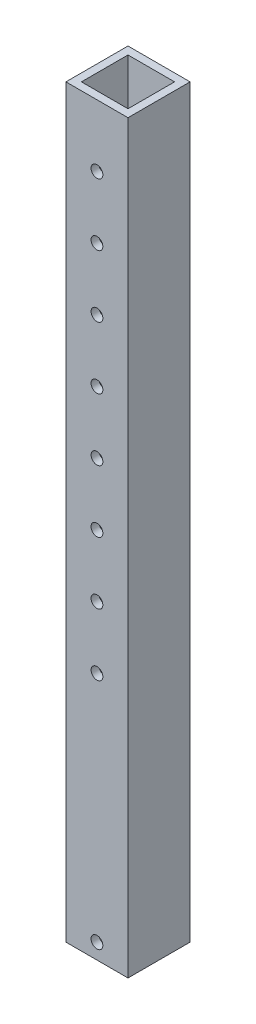
ISO-10303-21;
HEADER;
FILE_DESCRIPTION(('STEP AP214'),'2;1');
FILE_NAME('part.step','',(''),(''),'','','');
FILE_SCHEMA(('AUTOMOTIVE_DESIGN { 1 0 10303 214 1 1 1 1 }'));
ENDSEC;
DATA;
#1=APPLICATION_CONTEXT('core data for automotive mechanical design processes');
#2=APPLICATION_PROTOCOL_DEFINITION('international standard','automotive_design',2000,#1);
#3=PRODUCT_CONTEXT('',#1,'mechanical');
#4=PRODUCT('Part','Part','',(#3));
#5=PRODUCT_RELATED_PRODUCT_CATEGORY('part','',(#4));
#6=PRODUCT_DEFINITION_FORMATION('','',#4);
#7=PRODUCT_DEFINITION_CONTEXT('part definition',#1,'design');
#8=PRODUCT_DEFINITION('design','',#6,#7);
#9=PRODUCT_DEFINITION_SHAPE('','',#8);
#10=(LENGTH_UNIT() NAMED_UNIT(*) SI_UNIT(.MILLI.,.METRE.));
#11=(NAMED_UNIT(*) PLANE_ANGLE_UNIT() SI_UNIT($,.RADIAN.));
#12=(NAMED_UNIT(*) SI_UNIT($,.STERADIAN.) SOLID_ANGLE_UNIT());
#13=UNCERTAINTY_MEASURE_WITH_UNIT(LENGTH_MEASURE(1.E-05),#10,'distance_accuracy_value','');
#14=(GEOMETRIC_REPRESENTATION_CONTEXT(3) GLOBAL_UNCERTAINTY_ASSIGNED_CONTEXT((#13)) GLOBAL_UNIT_ASSIGNED_CONTEXT((#10,
#11,#12)) REPRESENTATION_CONTEXT('',''));
#15=CARTESIAN_POINT('',(0.,0.,0.));
#16=DIRECTION('',(0.,0.,1.));
#17=DIRECTION('',(1.,0.,0.));
#18=AXIS2_PLACEMENT_3D('',#15,#16,#17);
#19=CARTESIAN_POINT('',(0.,609.6,0.));
#20=DIRECTION('',(0.,-1.,0.));
#21=DIRECTION('',(0.,0.,-1.));
#22=AXIS2_PLACEMENT_3D('',#19,#20,#21);
#23=PLANE('',#22);
#24=DIRECTION('',(0.,0.,-1.));
#25=VECTOR('',#24,1.);
#26=CARTESIAN_POINT('',(25.4,609.6,25.4));
#27=LINE('',#26,#25);
#28=CARTESIAN_POINT('',(25.4,609.6,25.4));
#29=VERTEX_POINT('',#28);
#30=CARTESIAN_POINT('',(25.4,609.6,-25.4));
#31=VERTEX_POINT('',#30);
#32=EDGE_CURVE('E157',#29,#31,#27,.T.);
#33=ORIENTED_EDGE('',*,*,#32,.T.);
#34=DIRECTION('',(-1.,0.,0.));
#35=VECTOR('',#34,1.);
#36=CARTESIAN_POINT('',(-25.4,609.6,-25.4));
#37=LINE('',#36,#35);
#38=CARTESIAN_POINT('',(-25.4,609.6,-25.4));
#39=VERTEX_POINT('',#38);
#40=EDGE_CURVE('E161',#31,#39,#37,.T.);
#41=ORIENTED_EDGE('',*,*,#40,.T.);
#42=DIRECTION('',(0.,0.,1.));
#43=VECTOR('',#42,1.);
#44=CARTESIAN_POINT('',(-25.4,609.6,25.4));
#45=LINE('',#44,#43);
#46=CARTESIAN_POINT('',(-25.4,609.6,25.4));
#47=VERTEX_POINT('',#46);
#48=EDGE_CURVE('E165',#39,#47,#45,.T.);
#49=ORIENTED_EDGE('',*,*,#48,.T.);
#50=DIRECTION('',(1.,0.,0.));
#51=VECTOR('',#50,1.);
#52=CARTESIAN_POINT('',(-25.4,609.6,25.4));
#53=LINE('',#52,#51);
#54=EDGE_CURVE('E168',#47,#29,#53,.T.);
#55=ORIENTED_EDGE('',*,*,#54,.T.);
#56=EDGE_LOOP('',(#33,#41,#49,#55));
#57=FACE_BOUND('',#56,.T.);
#58=DIRECTION('',(0.,0.,-1.));
#59=VECTOR('',#58,1.);
#60=CARTESIAN_POINT('',(19.05,609.6,19.05));
#61=LINE('',#60,#59);
#62=CARTESIAN_POINT('',(19.05,609.6,19.05));
#63=VERTEX_POINT('',#62);
#64=CARTESIAN_POINT('',(19.05,609.6,-19.05));
#65=VERTEX_POINT('',#64);
#66=EDGE_CURVE('E107',#63,#65,#61,.T.);
#67=ORIENTED_EDGE('',*,*,#66,.F.);
#68=DIRECTION('',(1.,0.,0.));
#69=VECTOR('',#68,1.);
#70=CARTESIAN_POINT('',(-19.05,609.6,19.05));
#71=LINE('',#70,#69);
#72=CARTESIAN_POINT('',(-19.05,609.6,19.05));
#73=VERTEX_POINT('',#72);
#74=EDGE_CURVE('E133',#73,#63,#71,.T.);
#75=ORIENTED_EDGE('',*,*,#74,.F.);
#76=DIRECTION('',(0.,0.,1.));
#77=VECTOR('',#76,1.);
#78=CARTESIAN_POINT('',(-19.05,609.6,19.05));
#79=LINE('',#78,#77);
#80=CARTESIAN_POINT('',(-19.05,609.6,-19.05));
#81=VERTEX_POINT('',#80);
#82=EDGE_CURVE('E129',#81,#73,#79,.T.);
#83=ORIENTED_EDGE('',*,*,#82,.F.);
#84=DIRECTION('',(-1.,0.,0.));
#85=VECTOR('',#84,1.);
#86=CARTESIAN_POINT('',(-19.05,609.6,-19.05));
#87=LINE('',#86,#85);
#88=EDGE_CURVE('E116',#65,#81,#87,.T.);
#89=ORIENTED_EDGE('',*,*,#88,.F.);
#90=EDGE_LOOP('',(#67,#75,#83,#89));
#91=FACE_BOUND('',#90,.T.);
#92=ADVANCED_FACE('F39',(#57,#91),#23,.F.);
#93=CARTESIAN_POINT('',(0.,0.,0.));
#94=DIRECTION('',(0.,-1.,0.));
#95=DIRECTION('',(0.,0.,-1.));
#96=AXIS2_PLACEMENT_3D('',#93,#94,#95);
#97=PLANE('',#96);
#98=DIRECTION('',(0.,0.,-1.));
#99=VECTOR('',#98,1.);
#100=CARTESIAN_POINT('',(25.4,0.,25.4));
#101=LINE('',#100,#99);
#102=CARTESIAN_POINT('',(25.4,0.,25.4));
#103=VERTEX_POINT('',#102);
#104=CARTESIAN_POINT('',(25.4,0.,-25.4));
#105=VERTEX_POINT('',#104);
#106=EDGE_CURVE('E125',#103,#105,#101,.T.);
#107=ORIENTED_EDGE('',*,*,#106,.F.);
#108=DIRECTION('',(1.,0.,0.));
#109=VECTOR('',#108,1.);
#110=CARTESIAN_POINT('',(-25.4,0.,25.4));
#111=LINE('',#110,#109);
#112=CARTESIAN_POINT('',(-25.4,0.,25.4));
#113=VERTEX_POINT('',#112);
#114=EDGE_CURVE('E162',#113,#103,#111,.T.);
#115=ORIENTED_EDGE('',*,*,#114,.F.);
#116=DIRECTION('',(0.,0.,1.));
#117=VECTOR('',#116,1.);
#118=CARTESIAN_POINT('',(-25.4,0.,25.4));
#119=LINE('',#118,#117);
#120=CARTESIAN_POINT('',(-25.4,0.,-25.4));
#121=VERTEX_POINT('',#120);
#122=EDGE_CURVE('E178',#121,#113,#119,.T.);
#123=ORIENTED_EDGE('',*,*,#122,.F.);
#124=DIRECTION('',(-1.,0.,0.));
#125=VECTOR('',#124,1.);
#126=CARTESIAN_POINT('',(-25.4,0.,-25.4));
#127=LINE('',#126,#125);
#128=EDGE_CURVE('E175',#105,#121,#127,.T.);
#129=ORIENTED_EDGE('',*,*,#128,.F.);
#130=EDGE_LOOP('',(#107,#115,#123,#129));
#131=FACE_BOUND('',#130,.T.);
#132=DIRECTION('',(1.,0.,0.));
#133=VECTOR('',#132,1.);
#134=CARTESIAN_POINT('',(-19.05,0.,19.05));
#135=LINE('',#134,#133);
#136=CARTESIAN_POINT('',(-19.05,0.,19.05));
#137=VERTEX_POINT('',#136);
#138=CARTESIAN_POINT('',(19.05,0.,19.05));
#139=VERTEX_POINT('',#138);
#140=EDGE_CURVE('E117',#137,#139,#135,.T.);
#141=ORIENTED_EDGE('',*,*,#140,.T.);
#142=DIRECTION('',(0.,0.,-1.));
#143=VECTOR('',#142,1.);
#144=CARTESIAN_POINT('',(19.05,0.,19.05));
#145=LINE('',#144,#143);
#146=CARTESIAN_POINT('',(19.05,0.,-19.05));
#147=VERTEX_POINT('',#146);
#148=EDGE_CURVE('E65',#139,#147,#145,.T.);
#149=ORIENTED_EDGE('',*,*,#148,.T.);
#150=DIRECTION('',(-1.,0.,0.));
#151=VECTOR('',#150,1.);
#152=CARTESIAN_POINT('',(-19.05,0.,-19.05));
#153=LINE('',#152,#151);
#154=CARTESIAN_POINT('',(-19.05,0.,-19.05));
#155=VERTEX_POINT('',#154);
#156=EDGE_CURVE('E123',#147,#155,#153,.T.);
#157=ORIENTED_EDGE('',*,*,#156,.T.);
#158=DIRECTION('',(0.,0.,1.));
#159=VECTOR('',#158,1.);
#160=CARTESIAN_POINT('',(-19.05,0.,19.05));
#161=LINE('',#160,#159);
#162=EDGE_CURVE('E144',#155,#137,#161,.T.);
#163=ORIENTED_EDGE('',*,*,#162,.T.);
#164=EDGE_LOOP('',(#141,#149,#157,#163));
#165=FACE_BOUND('',#164,.T.);
#166=ADVANCED_FACE('F285',(#131,#165),#97,.T.);
#167=CARTESIAN_POINT('',(25.4,609.6,25.4));
#168=DIRECTION('',(-1.,0.,0.));
#169=DIRECTION('',(0.,0.,1.));
#170=AXIS2_PLACEMENT_3D('',#167,#168,#169);
#171=PLANE('',#170);
#172=ORIENTED_EDGE('',*,*,#106,.T.);
#173=DIRECTION('',(0.,-1.,0.));
#174=VECTOR('',#173,1.);
#175=CARTESIAN_POINT('',(25.4,609.6,-25.4));
#176=LINE('',#175,#174);
#177=EDGE_CURVE('E11',#31,#105,#176,.T.);
#178=ORIENTED_EDGE('',*,*,#177,.F.);
#179=ORIENTED_EDGE('',*,*,#32,.F.);
#180=DIRECTION('',(0.,-1.,0.));
#181=VECTOR('',#180,1.);
#182=CARTESIAN_POINT('',(25.4,609.6,25.4));
#183=LINE('',#182,#181);
#184=EDGE_CURVE('E171',#29,#103,#183,.T.);
#185=ORIENTED_EDGE('',*,*,#184,.T.);
#186=EDGE_LOOP('',(#172,#178,#179,#185));
#187=FACE_BOUND('',#186,.T.);
#188=ADVANCED_FACE('F41',(#187),#171,.F.);
#189=CARTESIAN_POINT('',(-25.4,609.6,-25.4));
#190=DIRECTION('',(0.,0.,1.));
#191=DIRECTION('',(1.,0.,0.));
#192=AXIS2_PLACEMENT_3D('',#189,#190,#191);
#193=PLANE('',#192);
#194=CARTESIAN_POINT('',(0.,558.8,-25.4000000000001));
#195=DIRECTION('',(0.,0.,1.));
#196=DIRECTION('',(1.,0.,0.));
#197=AXIS2_PLACEMENT_3D('',#194,#195,#196);
#198=CIRCLE('',#197,4.82600000000001);
#199=CARTESIAN_POINT('',(4.82600000000001,558.8,-25.4000000000001));
#200=VERTEX_POINT('',#199);
#201=EDGE_CURVE('E141',#200,#200,#198,.T.);
#202=ORIENTED_EDGE('',*,*,#201,.T.);
#203=EDGE_LOOP('',(#202));
#204=FACE_BOUND('',#203,.T.);
#205=CARTESIAN_POINT('',(5.28991153169859E-13,508.,-25.4000000000001));
#206=DIRECTION('',(0.,0.,1.));
#207=DIRECTION('',(1.,0.,0.));
#208=AXIS2_PLACEMENT_3D('',#205,#206,#207);
#209=CIRCLE('',#208,4.82600000000001);
#210=CARTESIAN_POINT('',(4.82600000000054,508.,-25.4000000000001));
#211=VERTEX_POINT('',#210);
#212=EDGE_CURVE('E244',#211,#211,#209,.T.);
#213=ORIENTED_EDGE('',*,*,#212,.T.);
#214=EDGE_LOOP('',(#213));
#215=FACE_BOUND('',#214,.T.);
#216=CARTESIAN_POINT('',(1.05798230633972E-12,457.2,-25.4000000000001));
#217=DIRECTION('',(0.,0.,1.));
#218=DIRECTION('',(1.,0.,0.));
#219=AXIS2_PLACEMENT_3D('',#216,#217,#218);
#220=CIRCLE('',#219,4.82600000000001);
#221=CARTESIAN_POINT('',(4.82600000000107,457.2,-25.4000000000001));
#222=VERTEX_POINT('',#221);
#223=EDGE_CURVE('E238',#222,#222,#220,.T.);
#224=ORIENTED_EDGE('',*,*,#223,.T.);
#225=EDGE_LOOP('',(#224));
#226=FACE_BOUND('',#225,.T.);
#227=CARTESIAN_POINT('',(1.58697345950958E-12,406.4,-25.4000000000001));
#228=DIRECTION('',(0.,0.,1.));
#229=DIRECTION('',(1.,0.,0.));
#230=AXIS2_PLACEMENT_3D('',#227,#228,#229);
#231=CIRCLE('',#230,4.82600000000001);
#232=CARTESIAN_POINT('',(4.8260000000016,406.4,-25.4000000000001));
#233=VERTEX_POINT('',#232);
#234=EDGE_CURVE('E233',#233,#233,#231,.T.);
#235=ORIENTED_EDGE('',*,*,#234,.T.);
#236=EDGE_LOOP('',(#235));
#237=FACE_BOUND('',#236,.T.);
#238=CARTESIAN_POINT('',(2.11596461267944E-12,355.6,-25.4000000000001));
#239=DIRECTION('',(0.,0.,1.));
#240=DIRECTION('',(1.,0.,0.));
#241=AXIS2_PLACEMENT_3D('',#238,#239,#240);
#242=CIRCLE('',#241,4.82600000000001);
#243=CARTESIAN_POINT('',(4.82600000000213,355.6,-25.4000000000001));
#244=VERTEX_POINT('',#243);
#245=EDGE_CURVE('E228',#244,#244,#242,.T.);
#246=ORIENTED_EDGE('',*,*,#245,.T.);
#247=EDGE_LOOP('',(#246));
#248=FACE_BOUND('',#247,.T.);
#249=CARTESIAN_POINT('',(2.6449557658493E-12,304.8,-25.4000000000001));
#250=DIRECTION('',(0.,0.,1.));
#251=DIRECTION('',(1.,0.,0.));
#252=AXIS2_PLACEMENT_3D('',#249,#250,#251);
#253=CIRCLE('',#252,4.82600000000001);
#254=CARTESIAN_POINT('',(4.82600000000266,304.8,-25.4000000000001));
#255=VERTEX_POINT('',#254);
#256=EDGE_CURVE('E222',#255,#255,#253,.T.);
#257=ORIENTED_EDGE('',*,*,#256,.T.);
#258=EDGE_LOOP('',(#257));
#259=FACE_BOUND('',#258,.T.);
#260=CARTESIAN_POINT('',(3.17394691901916E-12,254.,-25.4000000000001));
#261=DIRECTION('',(0.,0.,1.));
#262=DIRECTION('',(1.,0.,0.));
#263=AXIS2_PLACEMENT_3D('',#260,#261,#262);
#264=CIRCLE('',#263,4.82600000000001);
#265=CARTESIAN_POINT('',(4.82600000000319,254.,-25.4000000000001));
#266=VERTEX_POINT('',#265);
#267=EDGE_CURVE('E216',#266,#266,#264,.T.);
#268=ORIENTED_EDGE('',*,*,#267,.T.);
#269=EDGE_LOOP('',(#268));
#270=FACE_BOUND('',#269,.T.);
#271=CARTESIAN_POINT('',(3.70293807218901E-12,203.2,-25.4000000000001));
#272=DIRECTION('',(0.,0.,1.));
#273=DIRECTION('',(1.,0.,0.));
#274=AXIS2_PLACEMENT_3D('',#271,#272,#273);
#275=CIRCLE('',#274,4.82600000000001);
#276=CARTESIAN_POINT('',(4.82600000000371,203.2,-25.4000000000001));
#277=VERTEX_POINT('',#276);
#278=EDGE_CURVE('E210',#277,#277,#275,.T.);
#279=ORIENTED_EDGE('',*,*,#278,.T.);
#280=EDGE_LOOP('',(#279));
#281=FACE_BOUND('',#280,.T.);
#282=CARTESIAN_POINT('',(0.,12.7,-25.4000000000001));
#283=DIRECTION('',(0.,0.,1.));
#284=DIRECTION('',(1.,0.,0.));
#285=AXIS2_PLACEMENT_3D('',#282,#283,#284);
#286=CIRCLE('',#285,4.826);
#287=CARTESIAN_POINT('',(4.826,12.7,-25.4000000000001));
#288=VERTEX_POINT('',#287);
#289=EDGE_CURVE('E204',#288,#288,#286,.T.);
#290=ORIENTED_EDGE('',*,*,#289,.T.);
#291=EDGE_LOOP('',(#290));
#292=FACE_BOUND('',#291,.T.);
#293=ORIENTED_EDGE('',*,*,#128,.T.);
#294=DIRECTION('',(0.,-1.,0.));
#295=VECTOR('',#294,1.);
#296=CARTESIAN_POINT('',(-25.4,609.6,-25.4));
#297=LINE('',#296,#295);
#298=EDGE_CURVE('E49',#39,#121,#297,.T.);
#299=ORIENTED_EDGE('',*,*,#298,.F.);
#300=ORIENTED_EDGE('',*,*,#40,.F.);
#301=ORIENTED_EDGE('',*,*,#177,.T.);
#302=EDGE_LOOP('',(#293,#299,#300,#301));
#303=FACE_BOUND('',#302,.T.);
#304=ADVANCED_FACE('F265',(#204,#215,#226,#237,#248,#259,#270,#281,#292,#303),#193,.F.);
#305=CARTESIAN_POINT('',(-25.4,609.6,25.4));
#306=DIRECTION('',(1.,0.,0.));
#307=DIRECTION('',(0.,0.,-1.));
#308=AXIS2_PLACEMENT_3D('',#305,#306,#307);
#309=PLANE('',#308);
#310=ORIENTED_EDGE('',*,*,#122,.T.);
#311=DIRECTION('',(0.,-1.,0.));
#312=VECTOR('',#311,1.);
#313=CARTESIAN_POINT('',(-25.4,609.6,25.4));
#314=LINE('',#313,#312);
#315=EDGE_CURVE('E186',#47,#113,#314,.T.);
#316=ORIENTED_EDGE('',*,*,#315,.F.);
#317=ORIENTED_EDGE('',*,*,#48,.F.);
#318=ORIENTED_EDGE('',*,*,#298,.T.);
#319=EDGE_LOOP('',(#310,#316,#317,#318));
#320=FACE_BOUND('',#319,.T.);
#321=ADVANCED_FACE('F299',(#320),#309,.F.);
#322=CARTESIAN_POINT('',(-25.4,609.6,25.4));
#323=DIRECTION('',(0.,0.,-1.));
#324=DIRECTION('',(-1.,0.,0.));
#325=AXIS2_PLACEMENT_3D('',#322,#323,#324);
#326=PLANE('',#325);
#327=CARTESIAN_POINT('',(0.,558.8,25.4));
#328=DIRECTION('',(0.,0.,1.));
#329=DIRECTION('',(1.,0.,0.));
#330=AXIS2_PLACEMENT_3D('',#327,#328,#329);
#331=CIRCLE('',#330,4.82600000000001);
#332=CARTESIAN_POINT('',(4.82600000000001,558.8,25.4));
#333=VERTEX_POINT('',#332);
#334=EDGE_CURVE('E198',#333,#333,#331,.T.);
#335=ORIENTED_EDGE('',*,*,#334,.F.);
#336=EDGE_LOOP('',(#335));
#337=FACE_BOUND('',#336,.T.);
#338=CARTESIAN_POINT('',(5.28991153169859E-13,508.,25.4));
#339=DIRECTION('',(0.,0.,1.));
#340=DIRECTION('',(1.,0.,0.));
#341=AXIS2_PLACEMENT_3D('',#338,#339,#340);
#342=CIRCLE('',#341,4.82600000000001);
#343=CARTESIAN_POINT('',(4.82600000000054,508.,25.4));
#344=VERTEX_POINT('',#343);
#345=EDGE_CURVE('E446',#344,#344,#342,.T.);
#346=ORIENTED_EDGE('',*,*,#345,.F.);
#347=EDGE_LOOP('',(#346));
#348=FACE_BOUND('',#347,.T.);
#349=CARTESIAN_POINT('',(1.05798230633972E-12,457.2,25.4));
#350=DIRECTION('',(0.,0.,1.));
#351=DIRECTION('',(1.,0.,0.));
#352=AXIS2_PLACEMENT_3D('',#349,#350,#351);
#353=CIRCLE('',#352,4.82600000000001);
#354=CARTESIAN_POINT('',(4.82600000000107,457.2,25.4));
#355=VERTEX_POINT('',#354);
#356=EDGE_CURVE('E440',#355,#355,#353,.T.);
#357=ORIENTED_EDGE('',*,*,#356,.F.);
#358=EDGE_LOOP('',(#357));
#359=FACE_BOUND('',#358,.T.);
#360=CARTESIAN_POINT('',(1.58697345950958E-12,406.4,25.4));
#361=DIRECTION('',(0.,0.,1.));
#362=DIRECTION('',(1.,0.,0.));
#363=AXIS2_PLACEMENT_3D('',#360,#361,#362);
#364=CIRCLE('',#363,4.82600000000001);
#365=CARTESIAN_POINT('',(4.8260000000016,406.4,25.4));
#366=VERTEX_POINT('',#365);
#367=EDGE_CURVE('E437',#366,#366,#364,.T.);
#368=ORIENTED_EDGE('',*,*,#367,.F.);
#369=EDGE_LOOP('',(#368));
#370=FACE_BOUND('',#369,.T.);
#371=CARTESIAN_POINT('',(2.11596461267944E-12,355.6,25.4));
#372=DIRECTION('',(0.,0.,1.));
#373=DIRECTION('',(1.,0.,0.));
#374=AXIS2_PLACEMENT_3D('',#371,#372,#373);
#375=CIRCLE('',#374,4.82600000000001);
#376=CARTESIAN_POINT('',(4.82600000000213,355.6,25.4));
#377=VERTEX_POINT('',#376);
#378=EDGE_CURVE('E441',#377,#377,#375,.T.);
#379=ORIENTED_EDGE('',*,*,#378,.F.);
#380=EDGE_LOOP('',(#379));
#381=FACE_BOUND('',#380,.T.);
#382=CARTESIAN_POINT('',(2.6449557658493E-12,304.8,25.4));
#383=DIRECTION('',(0.,0.,1.));
#384=DIRECTION('',(1.,0.,0.));
#385=AXIS2_PLACEMENT_3D('',#382,#383,#384);
#386=CIRCLE('',#385,4.82600000000001);
#387=CARTESIAN_POINT('',(4.82600000000266,304.8,25.4));
#388=VERTEX_POINT('',#387);
#389=EDGE_CURVE('E449',#388,#388,#386,.T.);
#390=ORIENTED_EDGE('',*,*,#389,.F.);
#391=EDGE_LOOP('',(#390));
#392=FACE_BOUND('',#391,.T.);
#393=CARTESIAN_POINT('',(3.17394691901916E-12,254.,25.4));
#394=DIRECTION('',(0.,0.,1.));
#395=DIRECTION('',(1.,0.,0.));
#396=AXIS2_PLACEMENT_3D('',#393,#394,#395);
#397=CIRCLE('',#396,4.82600000000001);
#398=CARTESIAN_POINT('',(4.82600000000319,254.,25.4));
#399=VERTEX_POINT('',#398);
#400=EDGE_CURVE('E456',#399,#399,#397,.T.);
#401=ORIENTED_EDGE('',*,*,#400,.F.);
#402=EDGE_LOOP('',(#401));
#403=FACE_BOUND('',#402,.T.);
#404=CARTESIAN_POINT('',(3.70293807218901E-12,203.2,25.4));
#405=DIRECTION('',(0.,0.,1.));
#406=DIRECTION('',(1.,0.,0.));
#407=AXIS2_PLACEMENT_3D('',#404,#405,#406);
#408=CIRCLE('',#407,4.82600000000001);
#409=CARTESIAN_POINT('',(4.82600000000371,203.2,25.4));
#410=VERTEX_POINT('',#409);
#411=EDGE_CURVE('E459',#410,#410,#408,.T.);
#412=ORIENTED_EDGE('',*,*,#411,.F.);
#413=EDGE_LOOP('',(#412));
#414=FACE_BOUND('',#413,.T.);
#415=CARTESIAN_POINT('',(0.,12.7,25.4));
#416=DIRECTION('',(0.,0.,1.));
#417=DIRECTION('',(1.,0.,0.));
#418=AXIS2_PLACEMENT_3D('',#415,#416,#417);
#419=CIRCLE('',#418,4.826);
#420=CARTESIAN_POINT('',(4.826,12.7,25.4));
#421=VERTEX_POINT('',#420);
#422=EDGE_CURVE('E377',#421,#421,#419,.T.);
#423=ORIENTED_EDGE('',*,*,#422,.F.);
#424=EDGE_LOOP('',(#423));
#425=FACE_BOUND('',#424,.T.);
#426=ORIENTED_EDGE('',*,*,#114,.T.);
#427=ORIENTED_EDGE('',*,*,#184,.F.);
#428=ORIENTED_EDGE('',*,*,#54,.F.);
#429=ORIENTED_EDGE('',*,*,#315,.T.);
#430=EDGE_LOOP('',(#426,#427,#428,#429));
#431=FACE_BOUND('',#430,.T.);
#432=ADVANCED_FACE('F296',(#337,#348,#359,#370,#381,#392,#403,#414,#425,#431),#326,.F.);
#433=CARTESIAN_POINT('',(19.05,609.6,19.05));
#434=DIRECTION('',(-1.,0.,0.));
#435=DIRECTION('',(0.,0.,1.));
#436=AXIS2_PLACEMENT_3D('',#433,#434,#435);
#437=PLANE('',#436);
#438=ORIENTED_EDGE('',*,*,#148,.F.);
#439=DIRECTION('',(0.,-1.,0.));
#440=VECTOR('',#439,1.);
#441=CARTESIAN_POINT('',(19.05,609.6,19.05));
#442=LINE('',#441,#440);
#443=EDGE_CURVE('E111',#63,#139,#442,.T.);
#444=ORIENTED_EDGE('',*,*,#443,.F.);
#445=ORIENTED_EDGE('',*,*,#66,.T.);
#446=DIRECTION('',(0.,-1.,0.));
#447=VECTOR('',#446,1.);
#448=CARTESIAN_POINT('',(19.05,609.6,-19.05));
#449=LINE('',#448,#447);
#450=EDGE_CURVE('E110',#65,#147,#449,.T.);
#451=ORIENTED_EDGE('',*,*,#450,.T.);
#452=EDGE_LOOP('',(#438,#444,#445,#451));
#453=FACE_BOUND('',#452,.T.);
#454=ADVANCED_FACE('F109',(#453),#437,.T.);
#455=CARTESIAN_POINT('',(-19.05,609.6,-19.05));
#456=DIRECTION('',(0.,0.,1.));
#457=DIRECTION('',(1.,0.,0.));
#458=AXIS2_PLACEMENT_3D('',#455,#456,#457);
#459=PLANE('',#458);
#460=CARTESIAN_POINT('',(0.,558.8,-19.05));
#461=DIRECTION('',(0.,0.,1.));
#462=DIRECTION('',(1.,0.,0.));
#463=AXIS2_PLACEMENT_3D('',#460,#461,#462);
#464=CIRCLE('',#463,4.82600000000001);
#465=CARTESIAN_POINT('',(4.82600000000001,558.8,-19.05));
#466=VERTEX_POINT('',#465);
#467=EDGE_CURVE('E258',#466,#466,#464,.T.);
#468=ORIENTED_EDGE('',*,*,#467,.F.);
#469=EDGE_LOOP('',(#468));
#470=FACE_BOUND('',#469,.T.);
#471=CARTESIAN_POINT('',(5.28991153169859E-13,508.,-19.05));
#472=DIRECTION('',(0.,0.,1.));
#473=DIRECTION('',(1.,0.,0.));
#474=AXIS2_PLACEMENT_3D('',#471,#472,#473);
#475=CIRCLE('',#474,4.82600000000001);
#476=CARTESIAN_POINT('',(4.82600000000054,508.,-19.05));
#477=VERTEX_POINT('',#476);
#478=EDGE_CURVE('E237',#477,#477,#475,.T.);
#479=ORIENTED_EDGE('',*,*,#478,.F.);
#480=EDGE_LOOP('',(#479));
#481=FACE_BOUND('',#480,.T.);
#482=CARTESIAN_POINT('',(1.05798230633972E-12,457.2,-19.05));
#483=DIRECTION('',(0.,0.,1.));
#484=DIRECTION('',(1.,0.,0.));
#485=AXIS2_PLACEMENT_3D('',#482,#483,#484);
#486=CIRCLE('',#485,4.82600000000001);
#487=CARTESIAN_POINT('',(4.82600000000107,457.2,-19.05));
#488=VERTEX_POINT('',#487);
#489=EDGE_CURVE('E232',#488,#488,#486,.T.);
#490=ORIENTED_EDGE('',*,*,#489,.F.);
#491=EDGE_LOOP('',(#490));
#492=FACE_BOUND('',#491,.T.);
#493=CARTESIAN_POINT('',(1.58697345950958E-12,406.4,-19.05));
#494=DIRECTION('',(0.,0.,1.));
#495=DIRECTION('',(1.,0.,0.));
#496=AXIS2_PLACEMENT_3D('',#493,#494,#495);
#497=CIRCLE('',#496,4.82600000000001);
#498=CARTESIAN_POINT('',(4.8260000000016,406.4,-19.05));
#499=VERTEX_POINT('',#498);
#500=EDGE_CURVE('E227',#499,#499,#497,.T.);
#501=ORIENTED_EDGE('',*,*,#500,.F.);
#502=EDGE_LOOP('',(#501));
#503=FACE_BOUND('',#502,.T.);
#504=CARTESIAN_POINT('',(2.11596461267944E-12,355.6,-19.05));
#505=DIRECTION('',(0.,0.,1.));
#506=DIRECTION('',(1.,0.,0.));
#507=AXIS2_PLACEMENT_3D('',#504,#505,#506);
#508=CIRCLE('',#507,4.82600000000001);
#509=CARTESIAN_POINT('',(4.82600000000213,355.6,-19.05));
#510=VERTEX_POINT('',#509);
#511=EDGE_CURVE('E221',#510,#510,#508,.T.);
#512=ORIENTED_EDGE('',*,*,#511,.F.);
#513=EDGE_LOOP('',(#512));
#514=FACE_BOUND('',#513,.T.);
#515=CARTESIAN_POINT('',(2.6449557658493E-12,304.8,-19.05));
#516=DIRECTION('',(0.,0.,1.));
#517=DIRECTION('',(1.,0.,0.));
#518=AXIS2_PLACEMENT_3D('',#515,#516,#517);
#519=CIRCLE('',#518,4.82600000000001);
#520=CARTESIAN_POINT('',(4.82600000000266,304.8,-19.05));
#521=VERTEX_POINT('',#520);
#522=EDGE_CURVE('E215',#521,#521,#519,.T.);
#523=ORIENTED_EDGE('',*,*,#522,.F.);
#524=EDGE_LOOP('',(#523));
#525=FACE_BOUND('',#524,.T.);
#526=CARTESIAN_POINT('',(3.17394691901916E-12,254.,-19.05));
#527=DIRECTION('',(0.,0.,1.));
#528=DIRECTION('',(1.,0.,0.));
#529=AXIS2_PLACEMENT_3D('',#526,#527,#528);
#530=CIRCLE('',#529,4.82600000000001);
#531=CARTESIAN_POINT('',(4.82600000000319,254.,-19.05));
#532=VERTEX_POINT('',#531);
#533=EDGE_CURVE('E209',#532,#532,#530,.T.);
#534=ORIENTED_EDGE('',*,*,#533,.F.);
#535=EDGE_LOOP('',(#534));
#536=FACE_BOUND('',#535,.T.);
#537=CARTESIAN_POINT('',(3.70293807218901E-12,203.2,-19.05));
#538=DIRECTION('',(0.,0.,1.));
#539=DIRECTION('',(1.,0.,0.));
#540=AXIS2_PLACEMENT_3D('',#537,#538,#539);
#541=CIRCLE('',#540,4.82600000000001);
#542=CARTESIAN_POINT('',(4.82600000000371,203.2,-19.05));
#543=VERTEX_POINT('',#542);
#544=EDGE_CURVE('E203',#543,#543,#541,.T.);
#545=ORIENTED_EDGE('',*,*,#544,.F.);
#546=EDGE_LOOP('',(#545));
#547=FACE_BOUND('',#546,.T.);
#548=CARTESIAN_POINT('',(0.,12.7,-19.05));
#549=DIRECTION('',(0.,0.,1.));
#550=DIRECTION('',(1.,0.,0.));
#551=AXIS2_PLACEMENT_3D('',#548,#549,#550);
#552=CIRCLE('',#551,4.826);
#553=CARTESIAN_POINT('',(4.826,12.7,-19.05));
#554=VERTEX_POINT('',#553);
#555=EDGE_CURVE('E197',#554,#554,#552,.T.);
#556=ORIENTED_EDGE('',*,*,#555,.F.);
#557=EDGE_LOOP('',(#556));
#558=FACE_BOUND('',#557,.T.);
#559=ORIENTED_EDGE('',*,*,#156,.F.);
#560=ORIENTED_EDGE('',*,*,#450,.F.);
#561=ORIENTED_EDGE('',*,*,#88,.T.);
#562=DIRECTION('',(0.,-1.,0.));
#563=VECTOR('',#562,1.);
#564=CARTESIAN_POINT('',(-19.05,609.6,-19.05));
#565=LINE('',#564,#563);
#566=EDGE_CURVE('E126',#81,#155,#565,.T.);
#567=ORIENTED_EDGE('',*,*,#566,.T.);
#568=EDGE_LOOP('',(#559,#560,#561,#567));
#569=FACE_BOUND('',#568,.T.);
#570=ADVANCED_FACE('F120',(#470,#481,#492,#503,#514,#525,#536,#547,#558,#569),#459,.T.);
#571=CARTESIAN_POINT('',(-19.05,609.6,19.05));
#572=DIRECTION('',(1.,0.,0.));
#573=DIRECTION('',(0.,0.,-1.));
#574=AXIS2_PLACEMENT_3D('',#571,#572,#573);
#575=PLANE('',#574);
#576=ORIENTED_EDGE('',*,*,#162,.F.);
#577=ORIENTED_EDGE('',*,*,#566,.F.);
#578=ORIENTED_EDGE('',*,*,#82,.T.);
#579=DIRECTION('',(0.,-1.,0.));
#580=VECTOR('',#579,1.);
#581=CARTESIAN_POINT('',(-19.05,609.6,19.05));
#582=LINE('',#581,#580);
#583=EDGE_CURVE('E57',#73,#137,#582,.T.);
#584=ORIENTED_EDGE('',*,*,#583,.T.);
#585=EDGE_LOOP('',(#576,#577,#578,#584));
#586=FACE_BOUND('',#585,.T.);
#587=ADVANCED_FACE('F327',(#586),#575,.T.);
#588=CARTESIAN_POINT('',(-19.05,609.6,19.05));
#589=DIRECTION('',(0.,0.,-1.));
#590=DIRECTION('',(-1.,0.,0.));
#591=AXIS2_PLACEMENT_3D('',#588,#589,#590);
#592=PLANE('',#591);
#593=CARTESIAN_POINT('',(0.,558.8,19.05));
#594=DIRECTION('',(0.,0.,-1.));
#595=DIRECTION('',(-1.,0.,0.));
#596=AXIS2_PLACEMENT_3D('',#593,#594,#595);
#597=CIRCLE('',#596,4.82600000000001);
#598=CARTESIAN_POINT('',(-4.82600000000001,558.8,19.05));
#599=VERTEX_POINT('',#598);
#600=EDGE_CURVE('E43',#599,#599,#597,.T.);
#601=ORIENTED_EDGE('',*,*,#600,.F.);
#602=EDGE_LOOP('',(#601));
#603=FACE_BOUND('',#602,.T.);
#604=CARTESIAN_POINT('',(5.28991153169859E-13,508.,19.05));
#605=DIRECTION('',(0.,0.,-1.));
#606=DIRECTION('',(-1.,0.,0.));
#607=AXIS2_PLACEMENT_3D('',#604,#605,#606);
#608=CIRCLE('',#607,4.82600000000001);
#609=CARTESIAN_POINT('',(-4.82599999999948,508.,19.05));
#610=VERTEX_POINT('',#609);
#611=EDGE_CURVE('E234',#610,#610,#608,.T.);
#612=ORIENTED_EDGE('',*,*,#611,.F.);
#613=EDGE_LOOP('',(#612));
#614=FACE_BOUND('',#613,.T.);
#615=CARTESIAN_POINT('',(1.05798230633972E-12,457.2,19.05));
#616=DIRECTION('',(0.,0.,-1.));
#617=DIRECTION('',(-1.,0.,0.));
#618=AXIS2_PLACEMENT_3D('',#615,#616,#617);
#619=CIRCLE('',#618,4.82600000000001);
#620=CARTESIAN_POINT('',(-4.82599999999895,457.2,19.05));
#621=VERTEX_POINT('',#620);
#622=EDGE_CURVE('E229',#621,#621,#619,.T.);
#623=ORIENTED_EDGE('',*,*,#622,.F.);
#624=EDGE_LOOP('',(#623));
#625=FACE_BOUND('',#624,.T.);
#626=CARTESIAN_POINT('',(1.58697345950958E-12,406.4,19.05));
#627=DIRECTION('',(0.,0.,-1.));
#628=DIRECTION('',(-1.,0.,0.));
#629=AXIS2_PLACEMENT_3D('',#626,#627,#628);
#630=CIRCLE('',#629,4.82600000000001);
#631=CARTESIAN_POINT('',(-4.82599999999842,406.4,19.05));
#632=VERTEX_POINT('',#631);
#633=EDGE_CURVE('E223',#632,#632,#630,.T.);
#634=ORIENTED_EDGE('',*,*,#633,.F.);
#635=EDGE_LOOP('',(#634));
#636=FACE_BOUND('',#635,.T.);
#637=CARTESIAN_POINT('',(2.11596461267944E-12,355.6,19.05));
#638=DIRECTION('',(0.,0.,-1.));
#639=DIRECTION('',(-1.,0.,0.));
#640=AXIS2_PLACEMENT_3D('',#637,#638,#639);
#641=CIRCLE('',#640,4.82600000000001);
#642=CARTESIAN_POINT('',(-4.8259999999979,355.6,19.05));
#643=VERTEX_POINT('',#642);
#644=EDGE_CURVE('E217',#643,#643,#641,.T.);
#645=ORIENTED_EDGE('',*,*,#644,.F.);
#646=EDGE_LOOP('',(#645));
#647=FACE_BOUND('',#646,.T.);
#648=CARTESIAN_POINT('',(2.6449557658493E-12,304.8,19.05));
#649=DIRECTION('',(0.,0.,-1.));
#650=DIRECTION('',(-1.,0.,0.));
#651=AXIS2_PLACEMENT_3D('',#648,#649,#650);
#652=CIRCLE('',#651,4.82600000000001);
#653=CARTESIAN_POINT('',(-4.82599999999737,304.8,19.05));
#654=VERTEX_POINT('',#653);
#655=EDGE_CURVE('E211',#654,#654,#652,.T.);
#656=ORIENTED_EDGE('',*,*,#655,.F.);
#657=EDGE_LOOP('',(#656));
#658=FACE_BOUND('',#657,.T.);
#659=CARTESIAN_POINT('',(3.17394691901916E-12,254.,19.05));
#660=DIRECTION('',(0.,0.,-1.));
#661=DIRECTION('',(-1.,0.,0.));
#662=AXIS2_PLACEMENT_3D('',#659,#660,#661);
#663=CIRCLE('',#662,4.82600000000001);
#664=CARTESIAN_POINT('',(-4.82599999999684,254.,19.05));
#665=VERTEX_POINT('',#664);
#666=EDGE_CURVE('E205',#665,#665,#663,.T.);
#667=ORIENTED_EDGE('',*,*,#666,.F.);
#668=EDGE_LOOP('',(#667));
#669=FACE_BOUND('',#668,.T.);
#670=CARTESIAN_POINT('',(3.70293807218901E-12,203.2,19.05));
#671=DIRECTION('',(0.,0.,-1.));
#672=DIRECTION('',(-1.,0.,0.));
#673=AXIS2_PLACEMENT_3D('',#670,#671,#672);
#674=CIRCLE('',#673,4.82600000000001);
#675=CARTESIAN_POINT('',(-4.82599999999631,203.2,19.05));
#676=VERTEX_POINT('',#675);
#677=EDGE_CURVE('E199',#676,#676,#674,.T.);
#678=ORIENTED_EDGE('',*,*,#677,.F.);
#679=EDGE_LOOP('',(#678));
#680=FACE_BOUND('',#679,.T.);
#681=CARTESIAN_POINT('',(0.,12.7,19.05));
#682=DIRECTION('',(0.,0.,-1.));
#683=DIRECTION('',(-1.,0.,0.));
#684=AXIS2_PLACEMENT_3D('',#681,#682,#683);
#685=CIRCLE('',#684,4.826);
#686=CARTESIAN_POINT('',(-4.826,12.7,19.05));
#687=VERTEX_POINT('',#686);
#688=EDGE_CURVE('E193',#687,#687,#685,.T.);
#689=ORIENTED_EDGE('',*,*,#688,.F.);
#690=EDGE_LOOP('',(#689));
#691=FACE_BOUND('',#690,.T.);
#692=ORIENTED_EDGE('',*,*,#140,.F.);
#693=ORIENTED_EDGE('',*,*,#583,.F.);
#694=ORIENTED_EDGE('',*,*,#74,.T.);
#695=ORIENTED_EDGE('',*,*,#443,.T.);
#696=EDGE_LOOP('',(#692,#693,#694,#695));
#697=FACE_BOUND('',#696,.T.);
#698=ADVANCED_FACE('F324',(#603,#614,#625,#636,#647,#658,#669,#680,#691,#697),#592,.T.);
#699=CARTESIAN_POINT('',(0.,12.7,-584.2));
#700=DIRECTION('',(0.,0.,1.));
#701=DIRECTION('',(1.,0.,0.));
#702=AXIS2_PLACEMENT_3D('',#699,#700,#701);
#703=CYLINDRICAL_SURFACE('',#702,4.826);
#704=ORIENTED_EDGE('',*,*,#688,.T.);
#705=EDGE_LOOP('',(#704));
#706=FACE_BOUND('',#705,.T.);
#707=ORIENTED_EDGE('',*,*,#422,.T.);
#708=EDGE_LOOP('',(#707));
#709=FACE_BOUND('',#708,.T.);
#710=ADVANCED_FACE('F326',(#706,#709),#703,.F.);
#711=CARTESIAN_POINT('',(3.70293807218901E-12,203.2,-584.2));
#712=DIRECTION('',(0.,0.,1.));
#713=DIRECTION('',(1.,0.,0.));
#714=AXIS2_PLACEMENT_3D('',#711,#712,#713);
#715=CYLINDRICAL_SURFACE('',#714,4.82600000000001);
#716=ORIENTED_EDGE('',*,*,#677,.T.);
#717=EDGE_LOOP('',(#716));
#718=FACE_BOUND('',#717,.T.);
#719=ORIENTED_EDGE('',*,*,#411,.T.);
#720=EDGE_LOOP('',(#719));
#721=FACE_BOUND('',#720,.T.);
#722=ADVANCED_FACE('F334',(#718,#721),#715,.F.);
#723=CARTESIAN_POINT('',(3.17394691901916E-12,254.,-584.2));
#724=DIRECTION('',(0.,0.,1.));
#725=DIRECTION('',(1.,0.,0.));
#726=AXIS2_PLACEMENT_3D('',#723,#724,#725);
#727=CYLINDRICAL_SURFACE('',#726,4.82600000000001);
#728=ORIENTED_EDGE('',*,*,#666,.T.);
#729=EDGE_LOOP('',(#728));
#730=FACE_BOUND('',#729,.T.);
#731=ORIENTED_EDGE('',*,*,#400,.T.);
#732=EDGE_LOOP('',(#731));
#733=FACE_BOUND('',#732,.T.);
#734=ADVANCED_FACE('F471',(#730,#733),#727,.F.);
#735=CARTESIAN_POINT('',(2.6449557658493E-12,304.8,-584.2));
#736=DIRECTION('',(0.,0.,1.));
#737=DIRECTION('',(1.,0.,0.));
#738=AXIS2_PLACEMENT_3D('',#735,#736,#737);
#739=CYLINDRICAL_SURFACE('',#738,4.82600000000001);
#740=ORIENTED_EDGE('',*,*,#655,.T.);
#741=EDGE_LOOP('',(#740));
#742=FACE_BOUND('',#741,.T.);
#743=ORIENTED_EDGE('',*,*,#389,.T.);
#744=EDGE_LOOP('',(#743));
#745=FACE_BOUND('',#744,.T.);
#746=ADVANCED_FACE('F431',(#742,#745),#739,.F.);
#747=CARTESIAN_POINT('',(2.11596461267944E-12,355.6,-584.2));
#748=DIRECTION('',(0.,0.,1.));
#749=DIRECTION('',(1.,0.,0.));
#750=AXIS2_PLACEMENT_3D('',#747,#748,#749);
#751=CYLINDRICAL_SURFACE('',#750,4.82600000000001);
#752=ORIENTED_EDGE('',*,*,#644,.T.);
#753=EDGE_LOOP('',(#752));
#754=FACE_BOUND('',#753,.T.);
#755=ORIENTED_EDGE('',*,*,#378,.T.);
#756=EDGE_LOOP('',(#755));
#757=FACE_BOUND('',#756,.T.);
#758=ADVANCED_FACE('F423',(#754,#757),#751,.F.);
#759=CARTESIAN_POINT('',(1.58697345950958E-12,406.4,-584.2));
#760=DIRECTION('',(0.,0.,1.));
#761=DIRECTION('',(1.,0.,0.));
#762=AXIS2_PLACEMENT_3D('',#759,#760,#761);
#763=CYLINDRICAL_SURFACE('',#762,4.82600000000001);
#764=ORIENTED_EDGE('',*,*,#633,.T.);
#765=EDGE_LOOP('',(#764));
#766=FACE_BOUND('',#765,.T.);
#767=ORIENTED_EDGE('',*,*,#367,.T.);
#768=EDGE_LOOP('',(#767));
#769=FACE_BOUND('',#768,.T.);
#770=ADVANCED_FACE('F412',(#766,#769),#763,.F.);
#771=CARTESIAN_POINT('',(1.05798230633972E-12,457.2,-584.2));
#772=DIRECTION('',(0.,0.,1.));
#773=DIRECTION('',(1.,0.,0.));
#774=AXIS2_PLACEMENT_3D('',#771,#772,#773);
#775=CYLINDRICAL_SURFACE('',#774,4.82600000000001);
#776=ORIENTED_EDGE('',*,*,#622,.T.);
#777=EDGE_LOOP('',(#776));
#778=FACE_BOUND('',#777,.T.);
#779=ORIENTED_EDGE('',*,*,#356,.T.);
#780=EDGE_LOOP('',(#779));
#781=FACE_BOUND('',#780,.T.);
#782=ADVANCED_FACE('F419',(#778,#781),#775,.F.);
#783=CARTESIAN_POINT('',(5.28991153169859E-13,508.,-584.2));
#784=DIRECTION('',(0.,0.,1.));
#785=DIRECTION('',(1.,0.,0.));
#786=AXIS2_PLACEMENT_3D('',#783,#784,#785);
#787=CYLINDRICAL_SURFACE('',#786,4.82600000000001);
#788=ORIENTED_EDGE('',*,*,#611,.T.);
#789=EDGE_LOOP('',(#788));
#790=FACE_BOUND('',#789,.T.);
#791=ORIENTED_EDGE('',*,*,#345,.T.);
#792=EDGE_LOOP('',(#791));
#793=FACE_BOUND('',#792,.T.);
#794=ADVANCED_FACE('F280',(#790,#793),#787,.F.);
#795=CARTESIAN_POINT('',(0.,558.8,-584.2));
#796=DIRECTION('',(0.,0.,1.));
#797=DIRECTION('',(1.,0.,0.));
#798=AXIS2_PLACEMENT_3D('',#795,#796,#797);
#799=CYLINDRICAL_SURFACE('',#798,4.82600000000001);
#800=ORIENTED_EDGE('',*,*,#600,.T.);
#801=EDGE_LOOP('',(#800));
#802=FACE_BOUND('',#801,.T.);
#803=ORIENTED_EDGE('',*,*,#334,.T.);
#804=EDGE_LOOP('',(#803));
#805=FACE_BOUND('',#804,.T.);
#806=ADVANCED_FACE('F273',(#802,#805),#799,.F.);
#807=ORIENTED_EDGE('',*,*,#555,.T.);
#808=EDGE_LOOP('',(#807));
#809=FACE_BOUND('',#808,.T.);
#810=ORIENTED_EDGE('',*,*,#289,.F.);
#811=EDGE_LOOP('',(#810));
#812=FACE_BOUND('',#811,.T.);
#813=ADVANCED_FACE('F282',(#809,#812),#703,.F.);
#814=ORIENTED_EDGE('',*,*,#544,.T.);
#815=EDGE_LOOP('',(#814));
#816=FACE_BOUND('',#815,.T.);
#817=ORIENTED_EDGE('',*,*,#278,.F.);
#818=EDGE_LOOP('',(#817));
#819=FACE_BOUND('',#818,.T.);
#820=ADVANCED_FACE('F473',(#816,#819),#715,.F.);
#821=ORIENTED_EDGE('',*,*,#533,.T.);
#822=EDGE_LOOP('',(#821));
#823=FACE_BOUND('',#822,.T.);
#824=ORIENTED_EDGE('',*,*,#267,.F.);
#825=EDGE_LOOP('',(#824));
#826=FACE_BOUND('',#825,.T.);
#827=ADVANCED_FACE('F479',(#823,#826),#727,.F.);
#828=ORIENTED_EDGE('',*,*,#522,.T.);
#829=EDGE_LOOP('',(#828));
#830=FACE_BOUND('',#829,.T.);
#831=ORIENTED_EDGE('',*,*,#256,.F.);
#832=EDGE_LOOP('',(#831));
#833=FACE_BOUND('',#832,.T.);
#834=ADVANCED_FACE('F420',(#830,#833),#739,.F.);
#835=ORIENTED_EDGE('',*,*,#511,.T.);
#836=EDGE_LOOP('',(#835));
#837=FACE_BOUND('',#836,.T.);
#838=ORIENTED_EDGE('',*,*,#245,.F.);
#839=EDGE_LOOP('',(#838));
#840=FACE_BOUND('',#839,.T.);
#841=ADVANCED_FACE('F409',(#837,#840),#751,.F.);
#842=ORIENTED_EDGE('',*,*,#500,.T.);
#843=EDGE_LOOP('',(#842));
#844=FACE_BOUND('',#843,.T.);
#845=ORIENTED_EDGE('',*,*,#234,.F.);
#846=EDGE_LOOP('',(#845));
#847=FACE_BOUND('',#846,.T.);
#848=ADVANCED_FACE('F407',(#844,#847),#763,.F.);
#849=ORIENTED_EDGE('',*,*,#489,.T.);
#850=EDGE_LOOP('',(#849));
#851=FACE_BOUND('',#850,.T.);
#852=ORIENTED_EDGE('',*,*,#223,.F.);
#853=EDGE_LOOP('',(#852));
#854=FACE_BOUND('',#853,.T.);
#855=ADVANCED_FACE('F277',(#851,#854),#775,.F.);
#856=ORIENTED_EDGE('',*,*,#478,.T.);
#857=EDGE_LOOP('',(#856));
#858=FACE_BOUND('',#857,.T.);
#859=ORIENTED_EDGE('',*,*,#212,.F.);
#860=EDGE_LOOP('',(#859));
#861=FACE_BOUND('',#860,.T.);
#862=ADVANCED_FACE('F270',(#858,#861),#787,.F.);
#863=ORIENTED_EDGE('',*,*,#467,.T.);
#864=EDGE_LOOP('',(#863));
#865=FACE_BOUND('',#864,.T.);
#866=ORIENTED_EDGE('',*,*,#201,.F.);
#867=EDGE_LOOP('',(#866));
#868=FACE_BOUND('',#867,.T.);
#869=ADVANCED_FACE('F268',(#865,#868),#799,.F.);
#870=CLOSED_SHELL('',(#92,#166,#188,#304,#321,#432,#454,#570,#587,#698,#710,#722,#734,#746,#758,
#770,#782,#794,#806,#813,#820,#827,#834,#841,#848,#855,#862,#869));
#871=MANIFOLD_SOLID_BREP('B2',#870);
#872=ADVANCED_BREP_SHAPE_REPRESENTATION('',(#18,#871),#14);
#873=SHAPE_DEFINITION_REPRESENTATION(#9,#872);
ENDSEC;
END-ISO-10303-21;
